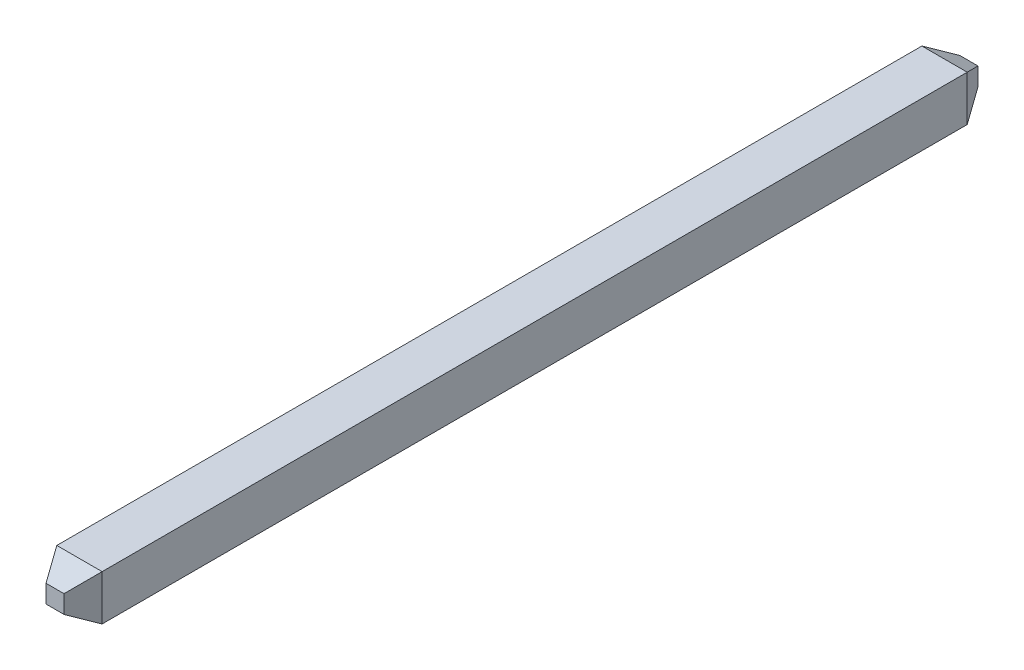
ISO-10303-21;
HEADER;
FILE_DESCRIPTION(('STEP AP214'),'2;1');
FILE_NAME('part.step','',(''),(''),'','','');
FILE_SCHEMA(('AUTOMOTIVE_DESIGN { 1 0 10303 214 1 1 1 1 }'));
ENDSEC;
DATA;
#1=APPLICATION_CONTEXT('core data for automotive mechanical design processes');
#2=APPLICATION_PROTOCOL_DEFINITION('international standard','automotive_design',2000,#1);
#3=PRODUCT_CONTEXT('',#1,'mechanical');
#4=PRODUCT('Part','Part','',(#3));
#5=PRODUCT_RELATED_PRODUCT_CATEGORY('part','',(#4));
#6=PRODUCT_DEFINITION_FORMATION('','',#4);
#7=PRODUCT_DEFINITION_CONTEXT('part definition',#1,'design');
#8=PRODUCT_DEFINITION('design','',#6,#7);
#9=PRODUCT_DEFINITION_SHAPE('','',#8);
#10=(LENGTH_UNIT() NAMED_UNIT(*) SI_UNIT(.MILLI.,.METRE.));
#11=(NAMED_UNIT(*) PLANE_ANGLE_UNIT() SI_UNIT($,.RADIAN.));
#12=(NAMED_UNIT(*) SI_UNIT($,.STERADIAN.) SOLID_ANGLE_UNIT());
#13=UNCERTAINTY_MEASURE_WITH_UNIT(LENGTH_MEASURE(1.E-05),#10,'distance_accuracy_value','');
#14=(GEOMETRIC_REPRESENTATION_CONTEXT(3) GLOBAL_UNCERTAINTY_ASSIGNED_CONTEXT((#13)) GLOBAL_UNIT_ASSIGNED_CONTEXT((#10,
#11,#12)) REPRESENTATION_CONTEXT('',''));
#15=CARTESIAN_POINT('',(0.,0.,0.));
#16=DIRECTION('',(0.,0.,1.));
#17=DIRECTION('',(1.,0.,0.));
#18=AXIS2_PLACEMENT_3D('',#15,#16,#17);
#19=CARTESIAN_POINT('',(7.74011510041924,0.945,-3.20872569516347));
#20=DIRECTION('',(0.872569516347452,0.,-0.488489958076083));
#21=DIRECTION('',(-0.488489958076083,0.,-0.872569516347452));
#22=AXIS2_PLACEMENT_3D('',#19,#20,#21);
#23=PLANE('',#22);
#24=DIRECTION('',(0.,1.,0.));
#25=VECTOR('',#24,1.);
#26=CARTESIAN_POINT('',(7.93534185664469,0.944999999999999,-2.86000017186176));
#27=LINE('',#26,#25);
#28=CARTESIAN_POINT('',(7.93534185663263,0.954999975315067,-2.85999984563027));
#29=VERTEX_POINT('',#28);
#30=CARTESIAN_POINT('',(7.93534201729187,1.58500016035866,-2.8599998849043));
#31=VERTEX_POINT('',#30);
#32=EDGE_CURVE('E118',#29,#31,#27,.T.);
#33=ORIENTED_EDGE('',*,*,#32,.F.);
#34=DIRECTION('',(0.43907261756865,-0.438284036988111,0.784297353956278));
#35=VECTOR('',#34,1.);
#36=CARTESIAN_POINT('',(7.745,1.145,-3.2));
#37=LINE('',#36,#35);
#38=CARTESIAN_POINT('',(7.745,1.145,-3.2));
#39=VERTEX_POINT('',#38);
#40=EDGE_CURVE('E116',#39,#29,#37,.T.);
#41=ORIENTED_EDGE('',*,*,#40,.F.);
#42=DIRECTION('',(0.,1.,0.));
#43=VECTOR('',#42,1.);
#44=CARTESIAN_POINT('',(7.745,1.135,-3.2));
#45=LINE('',#44,#43);
#46=CARTESIAN_POINT('',(7.745,1.395,-3.2));
#47=VERTEX_POINT('',#46);
#48=EDGE_CURVE('E79',#47,#39,#45,.F.);
#49=ORIENTED_EDGE('',*,*,#48,.F.);
#50=DIRECTION('',(-0.439072617568649,-0.438284036988111,-0.784297353956278));
#51=VECTOR('',#50,1.);
#52=CARTESIAN_POINT('',(7.93534185664468,1.585,-2.86000017186176));
#53=LINE('',#52,#51);
#54=EDGE_CURVE('E110',#31,#47,#53,.T.);
#55=ORIENTED_EDGE('',*,*,#54,.F.);
#56=EDGE_LOOP('',(#33,#41,#49,#55));
#57=FACE_BOUND('',#56,.T.);
#58=ADVANCED_FACE('F17',(#57),#23,.T.);
#59=CARTESIAN_POINT('',(7.74036702814295,0.945,9.50441734607014));
#60=DIRECTION('',(0.873317045523298,0.,0.487152273933376));
#61=DIRECTION('',(0.487152273933376,0.,-0.873317045523298));
#62=AXIS2_PLACEMENT_3D('',#59,#60,#61);
#63=PLANE('',#62);
#64=DIRECTION('',(-0.437799852400912,0.438586917260842,0.784839349959832));
#65=VECTOR('',#64,1.);
#66=CARTESIAN_POINT('',(7.93489789955165,0.954999686828527,9.15568378706484));
#67=LINE('',#66,#65);
#68=CARTESIAN_POINT('',(7.93489765454993,0.954999891076847,9.15568368845102));
#69=VERTEX_POINT('',#68);
#70=CARTESIAN_POINT('',(7.74523855088228,1.145,9.49568417561491));
#71=VERTEX_POINT('',#70);
#72=EDGE_CURVE('E122',#69,#71,#67,.T.);
#73=ORIENTED_EDGE('',*,*,#72,.F.);
#74=DIRECTION('',(0.,1.,0.));
#75=VECTOR('',#74,1.);
#76=CARTESIAN_POINT('',(7.93489853900643,0.944999999999999,9.15568372243698));
#77=LINE('',#76,#75);
#78=CARTESIAN_POINT('',(7.93489765280461,1.5850001770326,9.15568371270385));
#79=VERTEX_POINT('',#78);
#80=EDGE_CURVE('E89',#79,#69,#77,.F.);
#81=ORIENTED_EDGE('',*,*,#80,.F.);
#82=DIRECTION('',(0.437799852400914,0.438586917260841,-0.784839349959831));
#83=VECTOR('',#82,1.);
#84=CARTESIAN_POINT('',(7.74523855088228,1.395,9.49568417561491));
#85=LINE('',#84,#83);
#86=CARTESIAN_POINT('',(7.74523855088228,1.395,9.49568417561491));
#87=VERTEX_POINT('',#86);
#88=EDGE_CURVE('E84',#87,#79,#85,.T.);
#89=ORIENTED_EDGE('',*,*,#88,.F.);
#90=DIRECTION('',(0.,1.,0.));
#91=VECTOR('',#90,1.);
#92=CARTESIAN_POINT('',(7.74523855088228,1.405,9.49568417561491));
#93=LINE('',#92,#91);
#94=EDGE_CURVE('E20',#71,#87,#93,.T.);
#95=ORIENTED_EDGE('',*,*,#94,.F.);
#96=EDGE_LOOP('',(#73,#81,#89,#95));
#97=FACE_BOUND('',#96,.T.);
#98=ADVANCED_FACE('F86',(#97),#63,.T.);
#99=CARTESIAN_POINT('',(7.48523855088228,1.405,9.49568417561491));
#100=DIRECTION('',(0.,0.,1.));
#101=DIRECTION('',(1.,0.,0.));
#102=AXIS2_PLACEMENT_3D('',#99,#100,#101);
#103=PLANE('',#102);
#104=DIRECTION('',(1.,0.,0.));
#105=VECTOR('',#104,1.);
#106=CARTESIAN_POINT('',(7.2948966942376,1.395,9.49568417561491));
#107=LINE('',#106,#105);
#108=CARTESIAN_POINT('',(7.49523855088228,1.395,9.49568417561491));
#109=VERTEX_POINT('',#108);
#110=EDGE_CURVE('E93',#109,#87,#107,.T.);
#111=ORIENTED_EDGE('',*,*,#110,.F.);
#112=DIRECTION('',(0.,1.,0.));
#113=VECTOR('',#112,1.);
#114=CARTESIAN_POINT('',(7.49523855088228,0.945,9.49568417561491));
#115=LINE('',#114,#113);
#116=CARTESIAN_POINT('',(7.49523855088228,1.145,9.49568417561491));
#117=VERTEX_POINT('',#116);
#118=EDGE_CURVE('E129',#117,#109,#115,.T.);
#119=ORIENTED_EDGE('',*,*,#118,.F.);
#120=DIRECTION('',(1.,0.,0.));
#121=VECTOR('',#120,1.);
#122=CARTESIAN_POINT('',(7.2948966942376,1.145,9.49568417561491));
#123=LINE('',#122,#121);
#124=EDGE_CURVE('E98',#71,#117,#123,.F.);
#125=ORIENTED_EDGE('',*,*,#124,.F.);
#126=ORIENTED_EDGE('',*,*,#94,.T.);
#127=EDGE_LOOP('',(#111,#119,#125,#126));
#128=FACE_BOUND('',#127,.T.);
#129=ADVANCED_FACE('F95',(#128),#103,.T.);
#130=CARTESIAN_POINT('',(7.2948966942376,1.39012178454432,9.50441360938624));
#131=DIRECTION('',(0.,0.872943377132664,0.487821545567864));
#132=DIRECTION('',(0.,-0.487821545567864,0.872943377132664));
#133=AXIS2_PLACEMENT_3D('',#130,#131,#132);
#134=PLANE('',#133);
#135=DIRECTION('',(-0.439072459537927,0.438284700441663,-0.784297071672512));
#136=VECTOR('',#135,1.);
#137=CARTESIAN_POINT('',(7.49523855088228,1.395,9.49568417561491));
#138=LINE('',#137,#136);
#139=CARTESIAN_POINT('',(7.3048975037028,1.58500008247258,9.15568447138296));
#140=VERTEX_POINT('',#139);
#141=EDGE_CURVE('E102',#109,#140,#138,.T.);
#142=ORIENTED_EDGE('',*,*,#141,.F.);
#143=ORIENTED_EDGE('',*,*,#110,.T.);
#144=ORIENTED_EDGE('',*,*,#88,.T.);
#145=DIRECTION('',(1.,0.,0.));
#146=VECTOR('',#145,1.);
#147=CARTESIAN_POINT('',(7.62006658937282,1.585,9.15568497320463));
#148=LINE('',#147,#146);
#149=EDGE_CURVE('E131',#140,#79,#148,.T.);
#150=ORIENTED_EDGE('',*,*,#149,.F.);
#151=EDGE_LOOP('',(#142,#143,#144,#150));
#152=FACE_BOUND('',#151,.T.);
#153=ADVANCED_FACE('F100',(#152),#134,.T.);
#154=CARTESIAN_POINT('',(7.485,1.135,-3.2));
#155=DIRECTION('',(0.,0.,-1.));
#156=DIRECTION('',(-1.,0.,0.));
#157=AXIS2_PLACEMENT_3D('',#154,#155,#156);
#158=PLANE('',#157);
#159=ORIENTED_EDGE('',*,*,#48,.T.);
#160=DIRECTION('',(1.,0.,0.));
#161=VECTOR('',#160,1.);
#162=CARTESIAN_POINT('',(7.29534185664468,1.145,-3.2));
#163=LINE('',#162,#161);
#164=CARTESIAN_POINT('',(7.495,1.145,-3.2));
#165=VERTEX_POINT('',#164);
#166=EDGE_CURVE('E113',#165,#39,#163,.T.);
#167=ORIENTED_EDGE('',*,*,#166,.F.);
#168=DIRECTION('',(0.,1.,0.));
#169=VECTOR('',#168,1.);
#170=CARTESIAN_POINT('',(7.49500000000001,0.945,-3.2));
#171=LINE('',#170,#169);
#172=CARTESIAN_POINT('',(7.495,1.395,-3.2));
#173=VERTEX_POINT('',#172);
#174=EDGE_CURVE('E140',#173,#165,#171,.F.);
#175=ORIENTED_EDGE('',*,*,#174,.F.);
#176=DIRECTION('',(1.,0.,0.));
#177=VECTOR('',#176,1.);
#178=CARTESIAN_POINT('',(7.29534185664468,1.395,-3.2));
#179=LINE('',#178,#177);
#180=EDGE_CURVE('E105',#47,#173,#179,.F.);
#181=ORIENTED_EDGE('',*,*,#180,.F.);
#182=EDGE_LOOP('',(#159,#167,#175,#181));
#183=FACE_BOUND('',#182,.T.);
#184=ADVANCED_FACE('F184',(#183),#158,.T.);
#185=CARTESIAN_POINT('',(7.29534185664468,1.58987821545568,-2.85127073809043));
#186=DIRECTION('',(0.,0.872943377132663,-0.487821545567865));
#187=DIRECTION('',(0.,0.487821545567865,0.872943377132663));
#188=AXIS2_PLACEMENT_3D('',#185,#186,#187);
#189=PLANE('',#188);
#190=DIRECTION('',(1.,0.,0.));
#191=VECTOR('',#190,1.);
#192=CARTESIAN_POINT('',(7.62006658937282,1.585,-2.86000017186176));
#193=LINE('',#192,#191);
#194=CARTESIAN_POINT('',(7.30534144768619,1.58500070680911,-2.8599984305592));
#195=VERTEX_POINT('',#194);
#196=EDGE_CURVE('E137',#31,#195,#193,.F.);
#197=ORIENTED_EDGE('',*,*,#196,.F.);
#198=ORIENTED_EDGE('',*,*,#54,.T.);
#199=ORIENTED_EDGE('',*,*,#180,.T.);
#200=DIRECTION('',(0.437798396819596,-0.43858642908966,-0.784840434713052));
#201=VECTOR('',#200,1.);
#202=CARTESIAN_POINT('',(7.30534066407532,1.58500072063078,-2.8599980339447));
#203=LINE('',#202,#201);
#204=EDGE_CURVE('E145',#195,#173,#203,.T.);
#205=ORIENTED_EDGE('',*,*,#204,.F.);
#206=EDGE_LOOP('',(#197,#198,#199,#205));
#207=FACE_BOUND('',#206,.T.);
#208=ADVANCED_FACE('F182',(#207),#189,.T.);
#209=CARTESIAN_POINT('',(7.29534185664468,1.14987821545568,-3.20872943377133));
#210=DIRECTION('',(0.,-0.872943377132663,-0.487821545567865));
#211=DIRECTION('',(0.,0.487821545567865,-0.872943377132663));
#212=AXIS2_PLACEMENT_3D('',#209,#210,#211);
#213=PLANE('',#212);
#214=ORIENTED_EDGE('',*,*,#166,.T.);
#215=ORIENTED_EDGE('',*,*,#40,.T.);
#216=DIRECTION('',(1.,0.,0.));
#217=VECTOR('',#216,1.);
#218=CARTESIAN_POINT('',(7.29494834685547,0.955,-2.85999756200982));
#219=LINE('',#218,#217);
#220=CARTESIAN_POINT('',(7.30534198218489,0.954999729763457,-2.85999898491791));
#221=VERTEX_POINT('',#220);
#222=EDGE_CURVE('E35',#221,#29,#219,.T.);
#223=ORIENTED_EDGE('',*,*,#222,.F.);
#224=DIRECTION('',(-0.437798396819595,-0.438586429089664,0.78484043471305));
#225=VECTOR('',#224,1.);
#226=CARTESIAN_POINT('',(7.49500000000001,1.145,-3.2));
#227=LINE('',#226,#225);
#228=EDGE_CURVE('E143',#165,#221,#227,.T.);
#229=ORIENTED_EDGE('',*,*,#228,.F.);
#230=EDGE_LOOP('',(#214,#215,#223,#229));
#231=FACE_BOUND('',#230,.T.);
#232=ADVANCED_FACE('F185',(#231),#213,.T.);
#233=CARTESIAN_POINT('',(7.93534630826876,0.944999999999999,-2.98065701705514));
#234=DIRECTION('',(0.999999999319383,0.,3.68949151671205E-05));
#235=DIRECTION('',(3.68949151671205E-05,0.,-0.999999999319383));
#236=AXIS2_PLACEMENT_3D('',#233,#234,#235);
#237=PLANE('',#236);
#238=DIRECTION('',(3.69481335090154E-05,0.,-0.999999999317418));
#239=VECTOR('',#238,1.);
#240=CARTESIAN_POINT('',(7.93489789955165,1.585,9.15568372241339));
#241=LINE('',#240,#239);
#242=EDGE_CURVE('E134',#79,#31,#241,.T.);
#243=ORIENTED_EDGE('',*,*,#242,.F.);
#244=ORIENTED_EDGE('',*,*,#80,.T.);
#245=DIRECTION('',(-3.69481335090154E-05,0.,0.999999999317418));
#246=VECTOR('',#245,1.);
#247=CARTESIAN_POINT('',(7.93534185664468,0.955,-2.86000017186176));
#248=LINE('',#247,#246);
#249=EDGE_CURVE('E149',#29,#69,#248,.T.);
#250=ORIENTED_EDGE('',*,*,#249,.F.);
#251=ORIENTED_EDGE('',*,*,#32,.T.);
#252=EDGE_LOOP('',(#243,#244,#250,#251));
#253=FACE_BOUND('',#252,.T.);
#254=ADVANCED_FACE('F187',(#253),#237,.T.);
#255=CARTESIAN_POINT('',(7.2948966942376,0.950121784544321,9.14695491370534));
#256=DIRECTION('',(0.,-0.872943377132664,0.487821545567865));
#257=DIRECTION('',(0.,-0.487821545567865,-0.872943377132664));
#258=AXIS2_PLACEMENT_3D('',#255,#256,#257);
#259=PLANE('',#258);
#260=ORIENTED_EDGE('',*,*,#124,.T.);
#261=DIRECTION('',(0.439072459537929,0.438284700441656,0.784297071672515));
#262=VECTOR('',#261,1.);
#263=CARTESIAN_POINT('',(7.30489724886555,0.955000197635094,9.15568533818574));
#264=LINE('',#263,#262);
#265=CARTESIAN_POINT('',(7.30489781760238,0.955000116075706,9.15568487573227));
#266=VERTEX_POINT('',#265);
#267=EDGE_CURVE('E126',#266,#117,#264,.T.);
#268=ORIENTED_EDGE('',*,*,#267,.F.);
#269=DIRECTION('',(1.,0.,0.));
#270=VECTOR('',#269,1.);
#271=CARTESIAN_POINT('',(7.29494834685547,0.955,9.15568372241339));
#272=LINE('',#271,#270);
#273=EDGE_CURVE('E152',#69,#266,#272,.F.);
#274=ORIENTED_EDGE('',*,*,#273,.F.);
#275=ORIENTED_EDGE('',*,*,#72,.T.);
#276=EDGE_LOOP('',(#260,#268,#274,#275));
#277=FACE_BOUND('',#276,.T.);
#278=ADVANCED_FACE('F174',(#277),#259,.T.);
#279=CARTESIAN_POINT('',(7.50012345046305,0.945,9.50440987077839));
#280=DIRECTION('',(-0.872569516347454,0.,0.48848995807608));
#281=DIRECTION('',(0.48848995807608,0.,0.872569516347454));
#282=AXIS2_PLACEMENT_3D('',#279,#280,#281);
#283=PLANE('',#282);
#284=ORIENTED_EDGE('',*,*,#267,.T.);
#285=ORIENTED_EDGE('',*,*,#118,.T.);
#286=ORIENTED_EDGE('',*,*,#141,.T.);
#287=DIRECTION('',(0.,1.,0.));
#288=VECTOR('',#287,1.);
#289=CARTESIAN_POINT('',(7.30489853896028,0.945,9.15568497322817));
#290=LINE('',#289,#288);
#291=EDGE_CURVE('E155',#266,#140,#290,.T.);
#292=ORIENTED_EDGE('',*,*,#291,.F.);
#293=EDGE_LOOP('',(#284,#285,#286,#292));
#294=FACE_BOUND('',#293,.T.);
#295=ADVANCED_FACE('F177',(#294),#283,.T.);
#296=CARTESIAN_POINT('',(7.62006658937282,1.585,9.32634470275115));
#297=DIRECTION('',(0.,1.,0.));
#298=DIRECTION('',(0.,0.,1.));
#299=AXIS2_PLACEMENT_3D('',#296,#297,#298);
#300=PLANE('',#299);
#301=ORIENTED_EDGE('',*,*,#196,.T.);
#302=DIRECTION('',(-3.68949151674615E-05,0.,0.999999999319383));
#303=VECTOR('',#302,1.);
#304=CARTESIAN_POINT('',(7.30489224235438,1.58499980236491,9.32634821671993));
#305=LINE('',#304,#303);
#306=EDGE_CURVE('E158',#140,#195,#305,.F.);
#307=ORIENTED_EDGE('',*,*,#306,.F.);
#308=ORIENTED_EDGE('',*,*,#149,.T.);
#309=ORIENTED_EDGE('',*,*,#242,.T.);
#310=EDGE_LOOP('',(#301,#307,#308,#309));
#311=FACE_BOUND('',#310,.T.);
#312=ADVANCED_FACE('F179',(#311),#300,.T.);
#313=CARTESIAN_POINT('',(7.49987152273934,0.945,-3.20873317045523));
#314=DIRECTION('',(-0.873317045523296,0.,-0.487152273933378));
#315=DIRECTION('',(-0.487152273933378,0.,0.873317045523296));
#316=AXIS2_PLACEMENT_3D('',#313,#314,#315);
#317=PLANE('',#316);
#318=DIRECTION('',(0.,1.,0.));
#319=VECTOR('',#318,1.);
#320=CARTESIAN_POINT('',(7.30534185654839,0.945,-2.85999756199704));
#321=LINE('',#320,#319);
#322=EDGE_CURVE('E26',#195,#221,#321,.F.);
#323=ORIENTED_EDGE('',*,*,#322,.F.);
#324=ORIENTED_EDGE('',*,*,#204,.T.);
#325=ORIENTED_EDGE('',*,*,#174,.T.);
#326=ORIENTED_EDGE('',*,*,#228,.T.);
#327=EDGE_LOOP('',(#323,#324,#325,#326));
#328=FACE_BOUND('',#327,.T.);
#329=ADVANCED_FACE('F168',(#328),#317,.T.);
#330=CARTESIAN_POINT('',(7.29494834685547,0.955,3.17284922525592));
#331=DIRECTION('',(0.,-1.,0.));
#332=DIRECTION('',(0.,0.,-1.));
#333=AXIS2_PLACEMENT_3D('',#330,#331,#332);
#334=PLANE('',#333);
#335=ORIENTED_EDGE('',*,*,#249,.T.);
#336=ORIENTED_EDGE('',*,*,#273,.T.);
#337=DIRECTION('',(-3.68949151674615E-05,0.,0.999999999319383));
#338=VECTOR('',#337,1.);
#339=CARTESIAN_POINT('',(7.30489224235438,0.954999279369218,9.32634821671993));
#340=LINE('',#339,#338);
#341=EDGE_CURVE('E11',#221,#266,#340,.T.);
#342=ORIENTED_EDGE('',*,*,#341,.F.);
#343=ORIENTED_EDGE('',*,*,#222,.T.);
#344=EDGE_LOOP('',(#335,#336,#342,#343));
#345=FACE_BOUND('',#344,.T.);
#346=ADVANCED_FACE('F170',(#345),#334,.T.);
#347=CARTESIAN_POINT('',(7.30489224235438,0.945,9.32634821671993));
#348=DIRECTION('',(-0.999999999319383,0.,-3.68949151674615E-05));
#349=DIRECTION('',(-3.68949151674615E-05,0.,0.999999999319383));
#350=AXIS2_PLACEMENT_3D('',#347,#348,#349);
#351=PLANE('',#350);
#352=ORIENTED_EDGE('',*,*,#322,.T.);
#353=ORIENTED_EDGE('',*,*,#341,.T.);
#354=ORIENTED_EDGE('',*,*,#291,.T.);
#355=ORIENTED_EDGE('',*,*,#306,.T.);
#356=EDGE_LOOP('',(#352,#353,#354,#355));
#357=FACE_BOUND('',#356,.T.);
#358=ADVANCED_FACE('F164',(#357),#351,.T.);
#359=CLOSED_SHELL('',(#58,#98,#129,#153,#184,#208,#232,#254,#278,#295,#312,#329,#346,#358));
#360=MANIFOLD_SOLID_BREP('B1',#359);
#361=ADVANCED_BREP_SHAPE_REPRESENTATION('',(#18,#360),#14);
#362=SHAPE_DEFINITION_REPRESENTATION(#9,#361);
ENDSEC;
END-ISO-10303-21;
